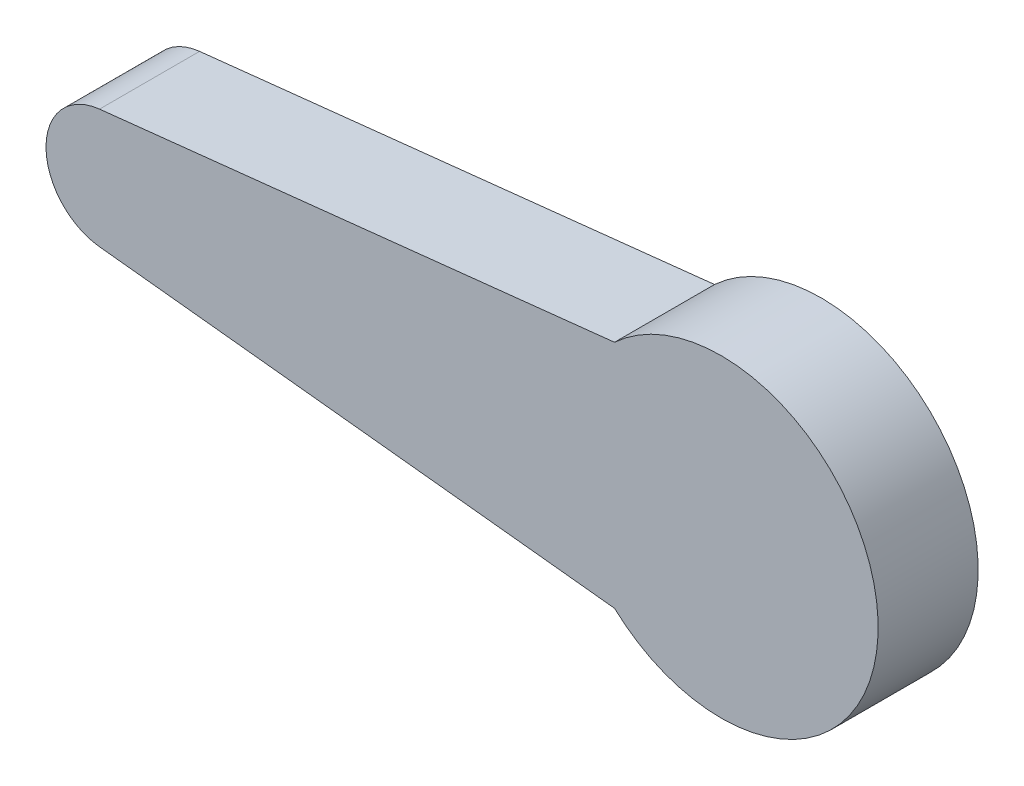
ISO-10303-21;
HEADER;
FILE_DESCRIPTION(('STEP AP214'),'2;1');
FILE_NAME('part.step','',(''),(''),'','','');
FILE_SCHEMA(('AUTOMOTIVE_DESIGN { 1 0 10303 214 1 1 1 1 }'));
ENDSEC;
DATA;
#1=APPLICATION_CONTEXT('core data for automotive mechanical design processes');
#2=APPLICATION_PROTOCOL_DEFINITION('international standard','automotive_design',2000,#1);
#3=PRODUCT_CONTEXT('',#1,'mechanical');
#4=PRODUCT('Part','Part','',(#3));
#5=PRODUCT_RELATED_PRODUCT_CATEGORY('part','',(#4));
#6=PRODUCT_DEFINITION_FORMATION('','',#4);
#7=PRODUCT_DEFINITION_CONTEXT('part definition',#1,'design');
#8=PRODUCT_DEFINITION('design','',#6,#7);
#9=PRODUCT_DEFINITION_SHAPE('','',#8);
#10=(LENGTH_UNIT() NAMED_UNIT(*) SI_UNIT(.MILLI.,.METRE.));
#11=(NAMED_UNIT(*) PLANE_ANGLE_UNIT() SI_UNIT($,.RADIAN.));
#12=(NAMED_UNIT(*) SI_UNIT($,.STERADIAN.) SOLID_ANGLE_UNIT());
#13=UNCERTAINTY_MEASURE_WITH_UNIT(LENGTH_MEASURE(1.E-05),#10,'distance_accuracy_value','');
#14=(GEOMETRIC_REPRESENTATION_CONTEXT(3) GLOBAL_UNCERTAINTY_ASSIGNED_CONTEXT((#13)) GLOBAL_UNIT_ASSIGNED_CONTEXT((#10,
#11,#12)) REPRESENTATION_CONTEXT('',''));
#15=CARTESIAN_POINT('',(0.,0.,0.));
#16=DIRECTION('',(0.,0.,1.));
#17=DIRECTION('',(1.,0.,0.));
#18=AXIS2_PLACEMENT_3D('',#15,#16,#17);
#19=CARTESIAN_POINT('',(-12.4001363165861,0.,0.));
#20=DIRECTION('',(0.,0.,1.));
#21=DIRECTION('',(1.,0.,0.));
#22=AXIS2_PLACEMENT_3D('',#19,#20,#21);
#23=PLANE('',#22);
#24=DIRECTION('',(-0.994225438983225,-0.10731158594771,0.));
#25=VECTOR('',#24,1.);
#26=CARTESIAN_POINT('',(7.93694518506527,4.60750982165337,0.));
#27=LINE('',#26,#25);
#28=CARTESIAN_POINT('',(7.93694518506527,4.60750982165337,0.));
#29=VERTEX_POINT('',#28);
#30=CARTESIAN_POINT('',(-12.657523048767,2.3846487267065,0.));
#31=VERTEX_POINT('',#30);
#32=EDGE_CURVE('E134',#29,#31,#27,.T.);
#33=ORIENTED_EDGE('',*,*,#32,.F.);
#34=CARTESIAN_POINT('',(12.2013646778512,0.,0.));
#35=DIRECTION('',(0.,0.,-1.));
#36=DIRECTION('',(-1.,0.,0.));
#37=AXIS2_PLACEMENT_3D('',#34,#35,#36);
#38=CIRCLE('',#37,6.2780905032569);
#39=CARTESIAN_POINT('',(7.93694518506527,-4.60750982165337,0.));
#40=VERTEX_POINT('',#39);
#41=EDGE_CURVE('E145',#29,#40,#38,.T.);
#42=ORIENTED_EDGE('',*,*,#41,.T.);
#43=DIRECTION('',(0.994225438983225,-0.10731158594771,0.));
#44=VECTOR('',#43,1.);
#45=CARTESIAN_POINT('',(-12.657523048767,-2.3846487267065,0.));
#46=LINE('',#45,#44);
#47=CARTESIAN_POINT('',(-12.657523048767,-2.3846487267065,0.));
#48=VERTEX_POINT('',#47);
#49=EDGE_CURVE('E152',#48,#40,#46,.T.);
#50=ORIENTED_EDGE('',*,*,#49,.F.);
#51=CARTESIAN_POINT('',(-12.4001363165861,0.,0.));
#52=DIRECTION('',(0.,0.,1.));
#53=DIRECTION('',(1.,0.,0.));
#54=AXIS2_PLACEMENT_3D('',#51,#52,#53);
#55=CIRCLE('',#54,2.3984990055628);
#56=EDGE_CURVE('E137',#31,#48,#55,.T.);
#57=ORIENTED_EDGE('',*,*,#56,.F.);
#58=EDGE_LOOP('',(#33,#42,#50,#57));
#59=FACE_BOUND('',#58,.T.);
#60=CARTESIAN_POINT('',(-2.30825995095074,2.49806605279446,0.));
#61=CARTESIAN_POINT('',(-2.73027096534099,2.49868152297986,0.));
#62=CARTESIAN_POINT('',(-3.36525519111259,2.31776714159565,0.));
#63=CARTESIAN_POINT('',(-4.0519471173828,1.79121945249872,0.));
#64=CARTESIAN_POINT('',(-4.45450445000801,1.26652861552728,0.));
#65=CARTESIAN_POINT('',(-4.70755649296628,0.655614107295277,0.));
#66=CARTESIAN_POINT('',(-4.79387213088173,0.,0.));
#67=CARTESIAN_POINT('',(-4.70755649296628,-0.655614107295276,0.));
#68=CARTESIAN_POINT('',(-4.45450445000801,-1.26652861552729,0.));
#69=CARTESIAN_POINT('',(-4.0519471173828,-1.79121945249872,0.));
#70=CARTESIAN_POINT('',(-3.36525519111259,-2.31776714159565,0.));
#71=CARTESIAN_POINT('',(-2.73027096534099,-2.49868152297986,0.));
#72=CARTESIAN_POINT('',(-2.30825995095074,-2.49806605279446,0.));
#73=B_SPLINE_CURVE_WITH_KNOTS('',3,(#60,#61,#62,#63,#64,#65,#66,#67,#68,#69,#70,#71,#72),
.UNSPECIFIED.,.F.,.F.,(4,1,1,1,1,1,1,1,1,1,4),(0.,0.162547315698738,0.246910500112196,
0.331273484688599,0.415637005846892,0.5,0.584362994153108,0.668726515311401,0.753089499887804,
0.837452684301262,1.),.UNSPECIFIED.);
#74=CARTESIAN_POINT('',(-2.30825995095074,2.49806605279446,0.));
#75=VERTEX_POINT('',#74);
#76=CARTESIAN_POINT('',(-2.30825995095074,-2.49806605279446,0.));
#77=VERTEX_POINT('',#76);
#78=EDGE_CURVE('E56',#75,#77,#73,.T.);
#79=ORIENTED_EDGE('',*,*,#78,.T.);
#80=DIRECTION('',(0.998250566900798,-0.0591253387494285,0.));
#81=VECTOR('',#80,1.);
#82=CARTESIAN_POINT('',(9.37504414469004,-3.19005595520139,0.));
#83=LINE('',#82,#81);
#84=CARTESIAN_POINT('',(9.37504414469004,-3.19005595520139,0.));
#85=VERTEX_POINT('',#84);
#86=EDGE_CURVE('E133',#77,#85,#83,.T.);
#87=ORIENTED_EDGE('',*,*,#86,.T.);
#88=CARTESIAN_POINT('',(9.37504414469004,-3.19005595520139,0.));
#89=CARTESIAN_POINT('',(9.74360040876109,-3.53484293919703,0.));
#90=CARTESIAN_POINT('',(10.5428570191187,-3.88633535555283,0.));
#91=CARTESIAN_POINT('',(11.7382013204245,-4.05165126945385,0.));
#92=CARTESIAN_POINT('',(12.7877855246039,-3.91194774983133,0.));
#93=CARTESIAN_POINT('',(13.7642990955492,-3.50777948619926,0.));
#94=CARTESIAN_POINT('',(14.6032502640424,-2.86396771618949,0.));
#95=CARTESIAN_POINT('',(15.2468503589831,-2.02521728614815,0.));
#96=CARTESIAN_POINT('',(15.6516651084562,-1.04811231295659,0.));
#97=CARTESIAN_POINT('',(15.7889928154445,-0.000691817754812136,0.));
#98=CARTESIAN_POINT('',(15.6535287568039,1.05087958765089,0.));
#99=CARTESIAN_POINT('',(15.2393957517555,2.01553180953456,0.));
#100=CARTESIAN_POINT('',(14.749448402042,2.72799658708562,0.));
#101=CARTESIAN_POINT('',(14.1725249859326,3.12361030474993,0.));
#102=CARTESIAN_POINT('',(13.6476475877295,3.58835164958077,0.));
#103=CARTESIAN_POINT('',(12.7816062725977,3.90400354803467,0.));
#104=CARTESIAN_POINT('',(11.739855888239,4.05377842345117,0.));
#105=CARTESIAN_POINT('',(10.54211336446,3.88537929441961,0.));
#106=CARTESIAN_POINT('',(9.74376271711854,3.53505160690367,0.));
#107=CARTESIAN_POINT('',(9.37504414469004,3.19005595520139,0.));
#108=B_SPLINE_CURVE_WITH_KNOTS('',3,(#88,#89,#90,#91,#92,#93,#94,#95,#96,#97,#98,#99,#100,#101,
#102,#103,#104,#105,#106,#107),.UNSPECIFIED.,.F.,.F.,(4,1,1,1,1,1,1,1,1,1,1,1,1,1,1,1,1,4),(0.,
0.0851368769983083,0.144403022869954,0.2036691687416,0.262935433986645,0.32220149870547,
0.381467600441595,0.440733878928586,0.499999999999802,0.559266121071018,0.618532399558009,
0.677798501294134,0.702497282971547,0.737064566013355,0.7963308312584,0.855596977130046,
0.914863123001692,1.),.UNSPECIFIED.);
#109=CARTESIAN_POINT('',(9.37504414469004,3.19005595520139,0.));
#110=VERTEX_POINT('',#109);
#111=EDGE_CURVE('E305',#85,#110,#108,.T.);
#112=ORIENTED_EDGE('',*,*,#111,.T.);
#113=DIRECTION('',(-0.998250566900798,-0.0591253387494285,0.));
#114=VECTOR('',#113,1.);
#115=CARTESIAN_POINT('',(-2.30825995095074,2.49806605279446,0.));
#116=LINE('',#115,#114);
#117=EDGE_CURVE('E129',#110,#75,#116,.T.);
#118=ORIENTED_EDGE('',*,*,#117,.T.);
#119=EDGE_LOOP('',(#79,#87,#112,#118));
#120=FACE_BOUND('',#119,.T.);
#121=ADVANCED_FACE('F41',(#59,#120),#23,.F.);
#122=CARTESIAN_POINT('',(7.93694518506527,4.60750982165337,4.));
#123=DIRECTION('',(0.10731158594771,-0.994225438983225,0.));
#124=DIRECTION('',(0.994225438983225,0.10731158594771,0.));
#125=AXIS2_PLACEMENT_3D('',#122,#123,#124);
#126=PLANE('',#125);
#127=ORIENTED_EDGE('',*,*,#32,.T.);
#128=DIRECTION('',(0.,0.,-1.));
#129=VECTOR('',#128,1.);
#130=CARTESIAN_POINT('',(-12.657523048767,2.3846487267065,4.));
#131=LINE('',#130,#129);
#132=CARTESIAN_POINT('',(-12.657523048767,2.3846487267065,4.));
#133=VERTEX_POINT('',#132);
#134=EDGE_CURVE('E11',#133,#31,#131,.T.);
#135=ORIENTED_EDGE('',*,*,#134,.F.);
#136=DIRECTION('',(-0.994225438983225,-0.10731158594771,0.));
#137=VECTOR('',#136,1.);
#138=CARTESIAN_POINT('',(7.93694518506527,4.60750982165337,4.));
#139=LINE('',#138,#137);
#140=CARTESIAN_POINT('',(7.93694518506527,4.60750982165337,4.));
#141=VERTEX_POINT('',#140);
#142=EDGE_CURVE('E143',#141,#133,#139,.T.);
#143=ORIENTED_EDGE('',*,*,#142,.F.);
#144=DIRECTION('',(0.,0.,-1.));
#145=VECTOR('',#144,1.);
#146=CARTESIAN_POINT('',(7.93694518506527,4.60750982165337,4.));
#147=LINE('',#146,#145);
#148=EDGE_CURVE('E65',#141,#29,#147,.T.);
#149=ORIENTED_EDGE('',*,*,#148,.T.);
#150=EDGE_LOOP('',(#127,#135,#143,#149));
#151=FACE_BOUND('',#150,.T.);
#152=ADVANCED_FACE('F43',(#151),#126,.F.);
#153=CARTESIAN_POINT('',(-12.4001363165861,0.,4.));
#154=DIRECTION('',(0.,0.,-1.));
#155=DIRECTION('',(-1.,0.,0.));
#156=AXIS2_PLACEMENT_3D('',#153,#154,#155);
#157=CYLINDRICAL_SURFACE('',#156,2.3984990055628);
#158=ORIENTED_EDGE('',*,*,#56,.T.);
#159=DIRECTION('',(0.,0.,-1.));
#160=VECTOR('',#159,1.);
#161=CARTESIAN_POINT('',(-12.657523048767,-2.3846487267065,4.));
#162=LINE('',#161,#160);
#163=CARTESIAN_POINT('',(-12.657523048767,-2.3846487267065,4.));
#164=VERTEX_POINT('',#163);
#165=EDGE_CURVE('E49',#164,#48,#162,.T.);
#166=ORIENTED_EDGE('',*,*,#165,.F.);
#167=CARTESIAN_POINT('',(-12.4001363165861,0.,4.));
#168=DIRECTION('',(0.,0.,1.));
#169=DIRECTION('',(1.,0.,0.));
#170=AXIS2_PLACEMENT_3D('',#167,#168,#169);
#171=CIRCLE('',#170,2.3984990055628);
#172=EDGE_CURVE('E91',#133,#164,#171,.T.);
#173=ORIENTED_EDGE('',*,*,#172,.F.);
#174=ORIENTED_EDGE('',*,*,#134,.T.);
#175=EDGE_LOOP('',(#158,#166,#173,#174));
#176=FACE_BOUND('',#175,.T.);
#177=ADVANCED_FACE('F172',(#176),#157,.T.);
#178=CARTESIAN_POINT('',(-12.657523048767,-2.3846487267065,4.));
#179=DIRECTION('',(0.10731158594771,0.994225438983225,0.));
#180=DIRECTION('',(-0.994225438983225,0.10731158594771,0.));
#181=AXIS2_PLACEMENT_3D('',#178,#179,#180);
#182=PLANE('',#181);
#183=ORIENTED_EDGE('',*,*,#49,.T.);
#184=DIRECTION('',(0.,0.,-1.));
#185=VECTOR('',#184,1.);
#186=CARTESIAN_POINT('',(7.93694518506527,-4.60750982165337,4.));
#187=LINE('',#186,#185);
#188=CARTESIAN_POINT('',(7.93694518506527,-4.60750982165337,4.));
#189=VERTEX_POINT('',#188);
#190=EDGE_CURVE('E158',#189,#40,#187,.T.);
#191=ORIENTED_EDGE('',*,*,#190,.F.);
#192=DIRECTION('',(0.994225438983225,-0.10731158594771,0.));
#193=VECTOR('',#192,1.);
#194=CARTESIAN_POINT('',(-12.657523048767,-2.3846487267065,4.));
#195=LINE('',#194,#193);
#196=EDGE_CURVE('E147',#164,#189,#195,.T.);
#197=ORIENTED_EDGE('',*,*,#196,.F.);
#198=ORIENTED_EDGE('',*,*,#165,.T.);
#199=EDGE_LOOP('',(#183,#191,#197,#198));
#200=FACE_BOUND('',#199,.T.);
#201=ADVANCED_FACE('F163',(#200),#182,.F.);
#202=CARTESIAN_POINT('',(12.2013646778512,0.,4.));
#203=DIRECTION('',(0.,0.,-1.));
#204=DIRECTION('',(-1.,0.,0.));
#205=AXIS2_PLACEMENT_3D('',#202,#203,#204);
#206=CYLINDRICAL_SURFACE('',#205,6.2780905032569);
#207=ORIENTED_EDGE('',*,*,#41,.F.);
#208=ORIENTED_EDGE('',*,*,#148,.F.);
#209=CARTESIAN_POINT('',(12.2013646778512,0.,4.));
#210=DIRECTION('',(0.,0.,-1.));
#211=DIRECTION('',(-1.,0.,0.));
#212=AXIS2_PLACEMENT_3D('',#209,#210,#211);
#213=CIRCLE('',#212,6.2780905032569);
#214=EDGE_CURVE('E149',#141,#189,#213,.T.);
#215=ORIENTED_EDGE('',*,*,#214,.T.);
#216=ORIENTED_EDGE('',*,*,#190,.T.);
#217=EDGE_LOOP('',(#207,#208,#215,#216));
#218=FACE_BOUND('',#217,.T.);
#219=ADVANCED_FACE('F167',(#218),#206,.T.);
#220=CARTESIAN_POINT('',(-12.4001363165861,0.,4.));
#221=DIRECTION('',(0.,0.,1.));
#222=DIRECTION('',(1.,0.,0.));
#223=AXIS2_PLACEMENT_3D('',#220,#221,#222);
#224=PLANE('',#223);
#225=ORIENTED_EDGE('',*,*,#142,.T.);
#226=ORIENTED_EDGE('',*,*,#172,.T.);
#227=ORIENTED_EDGE('',*,*,#196,.T.);
#228=ORIENTED_EDGE('',*,*,#214,.F.);
#229=EDGE_LOOP('',(#225,#226,#227,#228));
#230=FACE_BOUND('',#229,.T.);
#231=ADVANCED_FACE('F170',(#230),#224,.T.);
#232=CARTESIAN_POINT('',(-2.30825995095074,2.49806605279446,2.));
#233=CARTESIAN_POINT('',(-2.73027096534099,2.49868152297986,2.));
#234=CARTESIAN_POINT('',(-3.36525519111259,2.31776714159565,2.));
#235=CARTESIAN_POINT('',(-4.0519471173828,1.79121945249872,2.));
#236=CARTESIAN_POINT('',(-4.45450445000801,1.26652861552728,2.));
#237=CARTESIAN_POINT('',(-4.70755649296628,0.655614107295277,2.));
#238=CARTESIAN_POINT('',(-4.79387213088173,0.,2.));
#239=CARTESIAN_POINT('',(-4.70755649296628,-0.655614107295276,2.));
#240=CARTESIAN_POINT('',(-4.45450445000801,-1.26652861552729,2.));
#241=CARTESIAN_POINT('',(-4.0519471173828,-1.79121945249872,2.));
#242=CARTESIAN_POINT('',(-3.36525519111259,-2.31776714159565,2.));
#243=CARTESIAN_POINT('',(-2.73027096534099,-2.49868152297986,2.));
#244=CARTESIAN_POINT('',(-2.30825995095074,-2.49806605279446,2.));
#245=B_SPLINE_CURVE_WITH_KNOTS('',3,(#232,#233,#234,#235,#236,#237,#238,#239,#240,#241,#242,
#243,#244),.UNSPECIFIED.,.F.,.F.,(4,1,1,1,1,1,1,1,1,1,4),(0.,0.162547315698738,
0.246910500112196,0.331273484688599,0.415637005846892,0.5,0.584362994153108,0.668726515311401,
0.753089499887804,0.837452684301262,1.),.UNSPECIFIED.);
#246=DIRECTION('',(0.,0.,-1.));
#247=VECTOR('',#246,1.);
#248=SURFACE_OF_LINEAR_EXTRUSION('',#245,#247);
#249=ORIENTED_EDGE('',*,*,#78,.F.);
#250=DIRECTION('',(0.,0.,-1.));
#251=VECTOR('',#250,1.);
#252=CARTESIAN_POINT('',(-2.30825995095074,2.49806605279446,2.));
#253=LINE('',#252,#251);
#254=CARTESIAN_POINT('',(-2.30825995095074,2.49806605279446,2.));
#255=VERTEX_POINT('',#254);
#256=EDGE_CURVE('E128',#255,#75,#253,.T.);
#257=ORIENTED_EDGE('',*,*,#256,.F.);
#258=CARTESIAN_POINT('',(-2.30825995095074,-2.49806605279446,2.));
#259=VERTEX_POINT('',#258);
#260=EDGE_CURVE('E120',#255,#259,#245,.T.);
#261=ORIENTED_EDGE('',*,*,#260,.T.);
#262=DIRECTION('',(0.,0.,-1.));
#263=VECTOR('',#262,1.);
#264=CARTESIAN_POINT('',(-2.30825995095074,-2.49806605279446,2.));
#265=LINE('',#264,#263);
#266=EDGE_CURVE('E127',#259,#77,#265,.T.);
#267=ORIENTED_EDGE('',*,*,#266,.T.);
#268=EDGE_LOOP('',(#249,#257,#261,#267));
#269=FACE_BOUND('',#268,.T.);
#270=ADVANCED_FACE('F126',(#269),#248,.T.);
#271=CARTESIAN_POINT('',(9.37504414469004,-3.19005595520139,2.));
#272=DIRECTION('',(0.0591253387494286,0.998250566900798,0.));
#273=DIRECTION('',(-0.998250566900798,0.0591253387494286,0.));
#274=AXIS2_PLACEMENT_3D('',#271,#272,#273);
#275=PLANE('',#274);
#276=ORIENTED_EDGE('',*,*,#86,.F.);
#277=ORIENTED_EDGE('',*,*,#266,.F.);
#278=DIRECTION('',(0.998250566900798,-0.0591253387494285,0.));
#279=VECTOR('',#278,1.);
#280=CARTESIAN_POINT('',(9.37504414469004,-3.19005595520139,2.));
#281=LINE('',#280,#279);
#282=CARTESIAN_POINT('',(9.37504414469004,-3.19005595520139,2.));
#283=VERTEX_POINT('',#282);
#284=EDGE_CURVE('E116',#259,#283,#281,.T.);
#285=ORIENTED_EDGE('',*,*,#284,.T.);
#286=DIRECTION('',(0.,0.,-1.));
#287=VECTOR('',#286,1.);
#288=CARTESIAN_POINT('',(9.37504414469004,-3.19005595520139,2.));
#289=LINE('',#288,#287);
#290=EDGE_CURVE('E135',#283,#85,#289,.T.);
#291=ORIENTED_EDGE('',*,*,#290,.T.);
#292=EDGE_LOOP('',(#276,#277,#285,#291));
#293=FACE_BOUND('',#292,.T.);
#294=ADVANCED_FACE('F131',(#293),#275,.T.);
#295=CARTESIAN_POINT('',(9.37504414469004,-3.19005595520139,2.));
#296=CARTESIAN_POINT('',(9.74360040876109,-3.53484293919703,2.));
#297=CARTESIAN_POINT('',(10.5428570191187,-3.88633535555283,2.));
#298=CARTESIAN_POINT('',(11.7382013204245,-4.05165126945385,2.));
#299=CARTESIAN_POINT('',(12.7877855246039,-3.91194774983133,2.));
#300=CARTESIAN_POINT('',(13.7642990955492,-3.50777948619926,2.));
#301=CARTESIAN_POINT('',(14.6032502640424,-2.86396771618949,2.));
#302=CARTESIAN_POINT('',(15.2468503589831,-2.02521728614815,2.));
#303=CARTESIAN_POINT('',(15.6516651084562,-1.04811231295659,2.));
#304=CARTESIAN_POINT('',(15.7889928154445,-0.000691817754812136,2.));
#305=CARTESIAN_POINT('',(15.6535287568039,1.05087958765089,2.));
#306=CARTESIAN_POINT('',(15.2393957517555,2.01553180953456,2.));
#307=CARTESIAN_POINT('',(14.749448402042,2.72799658708562,2.));
#308=CARTESIAN_POINT('',(14.1725249859326,3.12361030474993,2.));
#309=CARTESIAN_POINT('',(13.6476475877295,3.58835164958077,2.));
#310=CARTESIAN_POINT('',(12.7816062725977,3.90400354803467,2.));
#311=CARTESIAN_POINT('',(11.739855888239,4.05377842345117,2.));
#312=CARTESIAN_POINT('',(10.54211336446,3.88537929441961,2.));
#313=CARTESIAN_POINT('',(9.74376271711854,3.53505160690367,2.));
#314=CARTESIAN_POINT('',(9.37504414469004,3.19005595520139,2.));
#315=B_SPLINE_CURVE_WITH_KNOTS('',3,(#295,#296,#297,#298,#299,#300,#301,#302,#303,#304,#305,
#306,#307,#308,#309,#310,#311,#312,#313,#314),.UNSPECIFIED.,.F.,.F.,(4,1,1,1,1,1,1,1,1,1,1,1,1,
1,1,1,1,4),(0.,0.0851368769983083,0.144403022869954,0.2036691687416,0.262935433986645,
0.32220149870547,0.381467600441595,0.440733878928586,0.499999999999802,0.559266121071018,
0.618532399558009,0.677798501294134,0.702497282971547,0.737064566013355,0.7963308312584,
0.855596977130046,0.914863123001692,1.),.UNSPECIFIED.);
#316=DIRECTION('',(0.,0.,-1.));
#317=VECTOR('',#316,1.);
#318=SURFACE_OF_LINEAR_EXTRUSION('',#315,#317);
#319=ORIENTED_EDGE('',*,*,#111,.F.);
#320=ORIENTED_EDGE('',*,*,#290,.F.);
#321=CARTESIAN_POINT('',(9.37504414469004,3.19005595520139,2.));
#322=VERTEX_POINT('',#321);
#323=EDGE_CURVE('E121',#283,#322,#315,.T.);
#324=ORIENTED_EDGE('',*,*,#323,.T.);
#325=DIRECTION('',(0.,0.,-1.));
#326=VECTOR('',#325,1.);
#327=CARTESIAN_POINT('',(9.37504414469004,3.19005595520139,2.));
#328=LINE('',#327,#326);
#329=EDGE_CURVE('E139',#322,#110,#328,.T.);
#330=ORIENTED_EDGE('',*,*,#329,.T.);
#331=EDGE_LOOP('',(#319,#320,#324,#330));
#332=FACE_BOUND('',#331,.T.);
#333=ADVANCED_FACE('F196',(#332),#318,.T.);
#334=CARTESIAN_POINT('',(-2.30825995095074,2.49806605279446,2.));
#335=DIRECTION('',(0.0591253387494286,-0.998250566900798,0.));
#336=DIRECTION('',(0.998250566900798,0.0591253387494286,0.));
#337=AXIS2_PLACEMENT_3D('',#334,#335,#336);
#338=PLANE('',#337);
#339=ORIENTED_EDGE('',*,*,#117,.F.);
#340=ORIENTED_EDGE('',*,*,#329,.F.);
#341=DIRECTION('',(-0.998250566900798,-0.0591253387494285,0.));
#342=VECTOR('',#341,1.);
#343=CARTESIAN_POINT('',(-2.30825995095074,2.49806605279446,2.));
#344=LINE('',#343,#342);
#345=EDGE_CURVE('E210',#322,#255,#344,.T.);
#346=ORIENTED_EDGE('',*,*,#345,.T.);
#347=ORIENTED_EDGE('',*,*,#256,.T.);
#348=EDGE_LOOP('',(#339,#340,#346,#347));
#349=FACE_BOUND('',#348,.T.);
#350=ADVANCED_FACE('F217',(#349),#338,.T.);
#351=CARTESIAN_POINT('',(-4.76510031148791,0.,2.));
#352=DIRECTION('',(0.,0.,1.));
#353=DIRECTION('',(1.,0.,0.));
#354=AXIS2_PLACEMENT_3D('',#351,#352,#353);
#355=PLANE('',#354);
#356=ORIENTED_EDGE('',*,*,#260,.F.);
#357=ORIENTED_EDGE('',*,*,#345,.F.);
#358=ORIENTED_EDGE('',*,*,#323,.F.);
#359=ORIENTED_EDGE('',*,*,#284,.F.);
#360=EDGE_LOOP('',(#356,#357,#358,#359));
#361=FACE_BOUND('',#360,.T.);
#362=ADVANCED_FACE('F118',(#361),#355,.F.);
#363=CLOSED_SHELL('',(#121,#152,#177,#201,#219,#231,#270,#294,#333,#350,#362));
#364=MANIFOLD_SOLID_BREP('B2',#363);
#365=ADVANCED_BREP_SHAPE_REPRESENTATION('',(#18,#364),#14);
#366=SHAPE_DEFINITION_REPRESENTATION(#9,#365);
ENDSEC;
END-ISO-10303-21;
